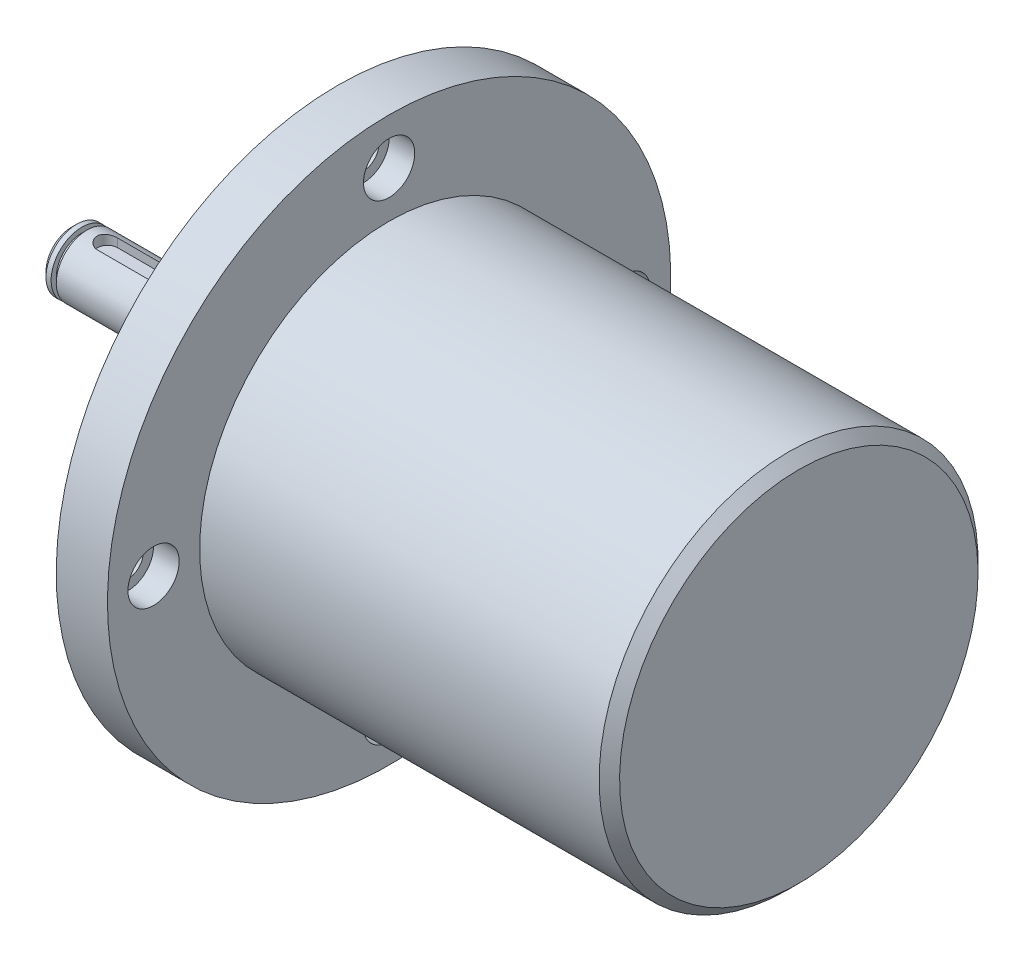
ISO-10303-21;
HEADER;
FILE_DESCRIPTION(('STEP AP214'),'2;1');
FILE_NAME('part.step','',(''),(''),'','','');
FILE_SCHEMA(('AUTOMOTIVE_DESIGN { 1 0 10303 214 1 1 1 1 }'));
ENDSEC;
DATA;
#1=APPLICATION_CONTEXT('core data for automotive mechanical design processes');
#2=APPLICATION_PROTOCOL_DEFINITION('international standard','automotive_design',2000,#1);
#3=PRODUCT_CONTEXT('',#1,'mechanical');
#4=PRODUCT('Part','Part','',(#3));
#5=PRODUCT_RELATED_PRODUCT_CATEGORY('part','',(#4));
#6=PRODUCT_DEFINITION_FORMATION('','',#4);
#7=PRODUCT_DEFINITION_CONTEXT('part definition',#1,'design');
#8=PRODUCT_DEFINITION('design','',#6,#7);
#9=PRODUCT_DEFINITION_SHAPE('','',#8);
#10=(LENGTH_UNIT() NAMED_UNIT(*) SI_UNIT(.MILLI.,.METRE.));
#11=(NAMED_UNIT(*) PLANE_ANGLE_UNIT() SI_UNIT($,.RADIAN.));
#12=(NAMED_UNIT(*) SI_UNIT($,.STERADIAN.) SOLID_ANGLE_UNIT());
#13=UNCERTAINTY_MEASURE_WITH_UNIT(LENGTH_MEASURE(1.E-05),#10,'distance_accuracy_value','');
#14=(GEOMETRIC_REPRESENTATION_CONTEXT(3) GLOBAL_UNCERTAINTY_ASSIGNED_CONTEXT((#13)) GLOBAL_UNIT_ASSIGNED_CONTEXT((#10,
#11,#12)) REPRESENTATION_CONTEXT('',''));
#15=CARTESIAN_POINT('',(0.,0.,0.));
#16=DIRECTION('',(0.,0.,1.));
#17=DIRECTION('',(1.,0.,0.));
#18=AXIS2_PLACEMENT_3D('',#15,#16,#17);
#19=CARTESIAN_POINT('',(142.,0.,0.));
#20=DIRECTION('',(1.,0.,0.));
#21=DIRECTION('',(0.,1.,0.));
#22=AXIS2_PLACEMENT_3D('',#19,#20,#21);
#23=CYLINDRICAL_SURFACE('',#22,5.99999999999998);
#24=CARTESIAN_POINT('',(3.,0.,0.));
#25=DIRECTION('',(1.,0.,0.));
#26=DIRECTION('',(0.,1.,0.));
#27=AXIS2_PLACEMENT_3D('',#24,#25,#26);
#28=CIRCLE('',#27,5.99999999999998);
#29=CARTESIAN_POINT('',(3.,5.99999999999998,0.));
#30=VERTEX_POINT('',#29);
#31=EDGE_CURVE('E174',#30,#30,#28,.T.);
#32=ORIENTED_EDGE('',*,*,#31,.T.);
#33=EDGE_LOOP('',(#32));
#34=FACE_BOUND('',#33,.T.);
#35=CARTESIAN_POINT('',(30.,0.,0.));
#36=DIRECTION('',(1.,0.,0.));
#37=DIRECTION('',(0.,1.,0.));
#38=AXIS2_PLACEMENT_3D('',#35,#36,#37);
#39=CIRCLE('',#38,5.99999999999998);
#40=CARTESIAN_POINT('',(30.,5.99999999999998,0.));
#41=VERTEX_POINT('',#40);
#42=EDGE_CURVE('E171',#41,#41,#39,.T.);
#43=ORIENTED_EDGE('',*,*,#42,.F.);
#44=EDGE_LOOP('',(#43));
#45=FACE_BOUND('',#44,.T.);
#46=DIRECTION('',(1.,0.,0.));
#47=VECTOR('',#46,1.);
#48=CARTESIAN_POINT('',(142.,5.65685424949236,2.));
#49=LINE('',#48,#47);
#50=CARTESIAN_POINT('',(19.,5.65685424949236,2.));
#51=VERTEX_POINT('',#50);
#52=CARTESIAN_POINT('',(7.,5.65685424949236,2.));
#53=VERTEX_POINT('',#52);
#54=EDGE_CURVE('E50',#51,#53,#49,.F.);
#55=ORIENTED_EDGE('',*,*,#54,.T.);
#56=CARTESIAN_POINT('',(7.,5.65685424949236,2.));
#57=CARTESIAN_POINT('',(6.94541900639777,5.65684884188676,2.0000014949184));
#58=CARTESIAN_POINT('',(6.89086587562134,5.65764519886489,1.99776424917478));
#59=CARTESIAN_POINT('',(6.78218283189021,5.6607865457844,1.9888512140728));
#60=CARTESIAN_POINT('',(6.72805280868061,5.66313111768242,1.98217662286705));
#61=CARTESIAN_POINT('',(6.56721571360973,5.672381844493,1.95562135046158));
#62=CARTESIAN_POINT('',(6.46163830745904,5.68150584999028,1.92920846605623));
#63=CARTESIAN_POINT('',(6.25674961511244,5.70456149397716,1.85991682366086));
#64=CARTESIAN_POINT('',(6.15743490625416,5.71849047905857,1.81704715197507));
#65=CARTESIAN_POINT('',(5.96732033198908,5.74957574438919,1.71614645792974));
#66=CARTESIAN_POINT('',(5.87652574186531,5.76673400456215,1.65810612564547));
#67=CARTESIAN_POINT('',(5.70255953735094,5.80308960804093,1.52610278704603));
#68=CARTESIAN_POINT('',(5.61977023907478,5.82233755536616,1.45164996064407));
#69=CARTESIAN_POINT('',(5.46758796441661,5.86027697385954,1.28997688598297));
#70=CARTESIAN_POINT('',(5.39819737348812,5.87896834543704,1.20275436910907));
#71=CARTESIAN_POINT('',(5.27304096239161,5.91427765988453,1.01520729191253));
#72=CARTESIAN_POINT('',(5.21767803119549,5.93082875123706,0.914600178716994));
#73=CARTESIAN_POINT('',(5.12481549662547,5.95939217209315,0.704858499931719));
#74=CARTESIAN_POINT('',(5.08731043635913,5.97140588786618,0.595726551186841));
#75=CARTESIAN_POINT('',(5.03252854781725,5.98918142285844,0.376058690956074));
#76=CARTESIAN_POINT('',(5.01459345489264,5.99514617977145,0.265703668920224));
#77=CARTESIAN_POINT('',(4.99736740294878,6.00087216807632,0.0433979389113458));
#78=CARTESIAN_POINT('',(4.9980720014605,6.00063487762603,-0.0685523824907852));
#79=CARTESIAN_POINT('',(5.01768856621331,5.9941207727053,-0.286207690558785));
#80=CARTESIAN_POINT('',(5.03588527591893,5.98808121982526,-0.391985405251073));
#81=CARTESIAN_POINT('',(5.08878639734824,5.97093921001645,-0.598888128753312));
#82=CARTESIAN_POINT('',(5.12349172441251,5.95983647235461,-0.700012879232928));
#83=CARTESIAN_POINT('',(5.20884273920126,5.93351336542607,-0.896305246061924));
#84=CARTESIAN_POINT('',(5.25969209024468,5.91824075676624,-0.991377011307984));
#85=CARTESIAN_POINT('',(5.3757199027814,5.88516775360086,-1.17184917819498));
#86=CARTESIAN_POINT('',(5.44090226209303,5.86736667195185,-1.25724693942937));
#87=CARTESIAN_POINT('',(5.58734209999369,5.83012543885477,-1.42019467942242));
#88=CARTESIAN_POINT('',(5.66921108721941,5.81064757359827,-1.4971872232254));
#89=CARTESIAN_POINT('',(5.84488297943233,5.77294980945701,-1.63654404964077));
#90=CARTESIAN_POINT('',(5.93868972480648,5.75473031831505,-1.69890360636763));
#91=CARTESIAN_POINT('',(6.13736035670656,5.72140062752633,-1.80800665118557));
#92=CARTESIAN_POINT('',(6.24236702986588,5.70634029896468,-1.85450601901537));
#93=CARTESIAN_POINT('',(6.45929395517991,5.68162194124077,-1.92892046140223));
#94=CARTESIAN_POINT('',(6.5712029867443,5.67195538817984,-1.95686487211071));
#95=CARTESIAN_POINT('',(6.73683727349596,5.66273084189438,-1.98331631256166));
#96=CARTESIAN_POINT('',(6.78928277970846,5.66053335389202,-1.98957012251023));
#97=CARTESIAN_POINT('',(6.89447615679963,5.65759407142796,-1.99790923214239));
#98=CARTESIAN_POINT('',(6.94722354908881,5.65685039859054,-1.99999991078996));
#99=CARTESIAN_POINT('',(7.,5.65685424949236,-2.));
#100=B_SPLINE_CURVE_WITH_KNOTS('',3,(#56,#57,#58,#59,#60,#61,#62,#63,#64,#65,#66,#67,#68,#69,
#70,#71,#72,#73,#74,#75,#76,#77,#78,#79,#80,#81,#82,#83,#84,#85,#86,#87,#88,#89,#90,#91,#92,#93,
#94,#95,#96,#97,#98,#99),.UNSPECIFIED.,.F.,.F.,(4,2,2,2,2,2,2,2,2,2,2,2,2,2,2,2,2,2,2,2,2,4),
(0.,0.163636969470865,0.327229772338923,0.653162396790745,0.978915321932472,1.30486862627062,
1.64233009925355,1.97985159727495,2.32618265866202,2.67240782242254,3.00658941454806,
3.34069136061285,3.6616883693147,3.98270317816496,4.30794037651935,4.63326613177537,
4.973881081161,5.31460588498484,5.6603605985608,6.00556734973678,6.16399790665503,
6.32222363058113),.UNSPECIFIED.);
#101=CARTESIAN_POINT('',(7.,5.65685424949236,-2.));
#102=VERTEX_POINT('',#101);
#103=EDGE_CURVE('E11',#53,#102,#100,.T.);
#104=ORIENTED_EDGE('',*,*,#103,.T.);
#105=DIRECTION('',(1.,0.,0.));
#106=VECTOR('',#105,1.);
#107=CARTESIAN_POINT('',(142.,5.65685424949236,-2.));
#108=LINE('',#107,#106);
#109=CARTESIAN_POINT('',(19.,5.65685424949236,-2.));
#110=VERTEX_POINT('',#109);
#111=EDGE_CURVE('E192',#102,#110,#108,.T.);
#112=ORIENTED_EDGE('',*,*,#111,.T.);
#113=CARTESIAN_POINT('',(19.,5.65685424949236,-2.));
#114=CARTESIAN_POINT('',(19.0545809936022,5.65684884188676,-2.0000014949184));
#115=CARTESIAN_POINT('',(19.1091341243787,5.65764519886488,-1.99776424917478));
#116=CARTESIAN_POINT('',(19.2178171681098,5.6607865457844,-1.9888512140728));
#117=CARTESIAN_POINT('',(19.2719471913194,5.66313111768242,-1.98217662286705));
#118=CARTESIAN_POINT('',(19.4327842863903,5.672381844493,-1.95562135046158));
#119=CARTESIAN_POINT('',(19.538361692541,5.68150584999028,-1.92920846605623));
#120=CARTESIAN_POINT('',(19.7432503848876,5.70456149397716,-1.85991682366086));
#121=CARTESIAN_POINT('',(19.8425650937458,5.71849047905857,-1.81704715197507));
#122=CARTESIAN_POINT('',(20.0326796680109,5.74957574438919,-1.71614645792974));
#123=CARTESIAN_POINT('',(20.1234742581347,5.76673400456215,-1.65810612564547));
#124=CARTESIAN_POINT('',(20.2974404626491,5.80308960804093,-1.52610278704602));
#125=CARTESIAN_POINT('',(20.3802297609252,5.82233755536616,-1.45164996064407));
#126=CARTESIAN_POINT('',(20.5324120355834,5.86027697385954,-1.28997688598297));
#127=CARTESIAN_POINT('',(20.6018026265119,5.87896834543704,-1.20275436910907));
#128=CARTESIAN_POINT('',(20.7269590376084,5.91427765988453,-1.01520729191253));
#129=CARTESIAN_POINT('',(20.7823219688045,5.93082875123706,-0.914600178716994));
#130=CARTESIAN_POINT('',(20.8751845033745,5.95939217209315,-0.704858499931718));
#131=CARTESIAN_POINT('',(20.9126895636409,5.97140588786618,-0.59572655118684));
#132=CARTESIAN_POINT('',(20.9674714521827,5.98918142285844,-0.376058690956073));
#133=CARTESIAN_POINT('',(20.9854065451074,5.99514617977145,-0.265703668920224));
#134=CARTESIAN_POINT('',(21.0026325970512,6.00087216807632,-0.0433979389113463));
#135=CARTESIAN_POINT('',(21.0019279985395,6.00063487762603,0.0685523824907843));
#136=CARTESIAN_POINT('',(20.9823114337867,5.9941207727053,0.286207690558784));
#137=CARTESIAN_POINT('',(20.9641147240811,5.98808121982526,0.391985405251072));
#138=CARTESIAN_POINT('',(20.9112136026518,5.97093921001645,0.598888128753312));
#139=CARTESIAN_POINT('',(20.8765082755875,5.95983647235461,0.700012879232928));
#140=CARTESIAN_POINT('',(20.7911572607987,5.93351336542607,0.896305246061924));
#141=CARTESIAN_POINT('',(20.7403079097553,5.91824075676624,0.991377011307984));
#142=CARTESIAN_POINT('',(20.6242800972186,5.88516775360086,1.17184917819498));
#143=CARTESIAN_POINT('',(20.559097737907,5.86736667195185,1.25724693942937));
#144=CARTESIAN_POINT('',(20.4126579000063,5.83012543885477,1.42019467942243));
#145=CARTESIAN_POINT('',(20.3307889127806,5.81064757359827,1.4971872232254));
#146=CARTESIAN_POINT('',(20.1551170205677,5.77294980945701,1.63654404964077));
#147=CARTESIAN_POINT('',(20.0613102751935,5.75473031831505,1.69890360636763));
#148=CARTESIAN_POINT('',(19.8626396432934,5.72140062752633,1.80800665118557));
#149=CARTESIAN_POINT('',(19.7576329701341,5.70634029896467,1.85450601901536));
#150=CARTESIAN_POINT('',(19.5407060448201,5.68162194124076,1.92892046140223));
#151=CARTESIAN_POINT('',(19.4287970132557,5.67195538817984,1.95686487211071));
#152=CARTESIAN_POINT('',(19.263162726504,5.66273084189438,1.98331631256166));
#153=CARTESIAN_POINT('',(19.2107172202915,5.66053335389202,1.98957012251023));
#154=CARTESIAN_POINT('',(19.1055238432004,5.65759407142796,1.99790923214239));
#155=CARTESIAN_POINT('',(19.0527764509112,5.65685039859054,1.99999991078996));
#156=CARTESIAN_POINT('',(19.,5.65685424949236,2.));
#157=B_SPLINE_CURVE_WITH_KNOTS('',3,(#113,#114,#115,#116,#117,#118,#119,#120,#121,#122,#123,
#124,#125,#126,#127,#128,#129,#130,#131,#132,#133,#134,#135,#136,#137,#138,#139,#140,#141,#142,
#143,#144,#145,#146,#147,#148,#149,#150,#151,#152,#153,#154,#155,#156),.UNSPECIFIED.,.F.,.F.,(4,
2,2,2,2,2,2,2,2,2,2,2,2,2,2,2,2,2,2,2,2,4),(0.,0.163636969470867,0.327229772338926,
0.653162396790745,0.978915321932474,1.30486862627062,1.64233009925355,1.97985159727495,
2.32618265866202,2.67240782242255,3.00658941454806,3.34069136061284,3.6616883693147,
3.98270317816496,4.30794037651935,4.63326613177537,4.97388108116101,5.31460588498485,
5.66036059856079,6.00556734973678,6.16399790665502,6.32222363058113),.UNSPECIFIED.);
#158=EDGE_CURVE('E211',#110,#51,#157,.T.);
#159=ORIENTED_EDGE('',*,*,#158,.T.);
#160=EDGE_LOOP('',(#55,#104,#112,#159));
#161=FACE_BOUND('',#160,.T.);
#162=ADVANCED_FACE('F36',(#34,#45,#161),#23,.T.);
#163=CARTESIAN_POINT('',(0.,0.,0.));
#164=DIRECTION('',(-1.,0.,0.));
#165=DIRECTION('',(0.,-1.,0.));
#166=AXIS2_PLACEMENT_3D('',#163,#164,#165);
#167=PLANE('',#166);
#168=CARTESIAN_POINT('',(0.,0.,0.));
#169=DIRECTION('',(1.,0.,0.));
#170=DIRECTION('',(0.,1.,0.));
#171=AXIS2_PLACEMENT_3D('',#168,#169,#170);
#172=CIRCLE('',#171,5.);
#173=CARTESIAN_POINT('',(0.,5.,0.));
#174=VERTEX_POINT('',#173);
#175=EDGE_CURVE('E189',#174,#174,#172,.T.);
#176=ORIENTED_EDGE('',*,*,#175,.F.);
#177=EDGE_LOOP('',(#176));
#178=FACE_BOUND('',#177,.T.);
#179=ADVANCED_FACE('F38',(#178),#167,.T.);
#180=CARTESIAN_POINT('',(1.,0.,0.));
#181=DIRECTION('',(1.,0.,0.));
#182=DIRECTION('',(0.,1.,0.));
#183=AXIS2_PLACEMENT_3D('',#180,#181,#182);
#184=CONICAL_SURFACE('',#183,5.99999999999998,0.785398163397442);
#185=ORIENTED_EDGE('',*,*,#175,.T.);
#186=EDGE_LOOP('',(#185));
#187=FACE_BOUND('',#186,.T.);
#188=CARTESIAN_POINT('',(1.,0.,0.));
#189=DIRECTION('',(1.,0.,0.));
#190=DIRECTION('',(0.,1.,0.));
#191=AXIS2_PLACEMENT_3D('',#188,#189,#190);
#192=CIRCLE('',#191,5.99999999999998);
#193=CARTESIAN_POINT('',(1.,5.99999999999998,0.));
#194=VERTEX_POINT('',#193);
#195=EDGE_CURVE('E186',#194,#194,#192,.T.);
#196=ORIENTED_EDGE('',*,*,#195,.F.);
#197=EDGE_LOOP('',(#196));
#198=FACE_BOUND('',#197,.T.);
#199=ADVANCED_FACE('F335',(#187,#198),#184,.T.);
#200=CARTESIAN_POINT('',(142.,0.,0.));
#201=DIRECTION('',(1.,0.,0.));
#202=DIRECTION('',(0.,1.,0.));
#203=AXIS2_PLACEMENT_3D('',#200,#201,#202);
#204=CYLINDRICAL_SURFACE('',#203,5.99999999999998);
#205=ORIENTED_EDGE('',*,*,#195,.T.);
#206=EDGE_LOOP('',(#205));
#207=FACE_BOUND('',#206,.T.);
#208=CARTESIAN_POINT('',(2.,0.,0.));
#209=DIRECTION('',(1.,0.,0.));
#210=DIRECTION('',(0.,1.,0.));
#211=AXIS2_PLACEMENT_3D('',#208,#209,#210);
#212=CIRCLE('',#211,5.99999999999998);
#213=CARTESIAN_POINT('',(2.,5.99999999999998,0.));
#214=VERTEX_POINT('',#213);
#215=EDGE_CURVE('E183',#214,#214,#212,.T.);
#216=ORIENTED_EDGE('',*,*,#215,.F.);
#217=EDGE_LOOP('',(#216));
#218=FACE_BOUND('',#217,.T.);
#219=ADVANCED_FACE('F534',(#207,#218),#204,.T.);
#220=CARTESIAN_POINT('',(2.,5.99999999999998,0.));
#221=DIRECTION('',(1.,0.,0.));
#222=DIRECTION('',(0.,1.,0.));
#223=AXIS2_PLACEMENT_3D('',#220,#221,#222);
#224=PLANE('',#223);
#225=ORIENTED_EDGE('',*,*,#215,.T.);
#226=EDGE_LOOP('',(#225));
#227=FACE_BOUND('',#226,.T.);
#228=CARTESIAN_POINT('',(2.,0.,0.));
#229=DIRECTION('',(1.,0.,0.));
#230=DIRECTION('',(0.,1.,0.));
#231=AXIS2_PLACEMENT_3D('',#228,#229,#230);
#232=CIRCLE('',#231,4.99999999999998);
#233=CARTESIAN_POINT('',(2.,4.99999999999998,0.));
#234=VERTEX_POINT('',#233);
#235=EDGE_CURVE('E180',#234,#234,#232,.T.);
#236=ORIENTED_EDGE('',*,*,#235,.F.);
#237=EDGE_LOOP('',(#236));
#238=FACE_BOUND('',#237,.T.);
#239=ADVANCED_FACE('F524',(#227,#238),#224,.T.);
#240=CARTESIAN_POINT('',(142.,0.,0.));
#241=DIRECTION('',(1.,0.,0.));
#242=DIRECTION('',(0.,1.,0.));
#243=AXIS2_PLACEMENT_3D('',#240,#241,#242);
#244=CYLINDRICAL_SURFACE('',#243,4.99999999999998);
#245=ORIENTED_EDGE('',*,*,#235,.T.);
#246=EDGE_LOOP('',(#245));
#247=FACE_BOUND('',#246,.T.);
#248=CARTESIAN_POINT('',(3.,0.,0.));
#249=DIRECTION('',(1.,0.,0.));
#250=DIRECTION('',(0.,1.,0.));
#251=AXIS2_PLACEMENT_3D('',#248,#249,#250);
#252=CIRCLE('',#251,4.99999999999998);
#253=CARTESIAN_POINT('',(3.,4.99999999999998,0.));
#254=VERTEX_POINT('',#253);
#255=EDGE_CURVE('E177',#254,#254,#252,.T.);
#256=ORIENTED_EDGE('',*,*,#255,.F.);
#257=EDGE_LOOP('',(#256));
#258=FACE_BOUND('',#257,.T.);
#259=ADVANCED_FACE('F327',(#247,#258),#244,.T.);
#260=CARTESIAN_POINT('',(3.,4.99999999999998,0.));
#261=DIRECTION('',(-1.,0.,0.));
#262=DIRECTION('',(0.,-1.,0.));
#263=AXIS2_PLACEMENT_3D('',#260,#261,#262);
#264=PLANE('',#263);
#265=ORIENTED_EDGE('',*,*,#255,.T.);
#266=EDGE_LOOP('',(#265));
#267=FACE_BOUND('',#266,.T.);
#268=ORIENTED_EDGE('',*,*,#31,.F.);
#269=EDGE_LOOP('',(#268));
#270=FACE_BOUND('',#269,.T.);
#271=ADVANCED_FACE('F322',(#267,#270),#264,.T.);
#272=CARTESIAN_POINT('',(30.,5.99999999999998,0.));
#273=DIRECTION('',(-1.,0.,0.));
#274=DIRECTION('',(0.,-1.,0.));
#275=AXIS2_PLACEMENT_3D('',#272,#273,#274);
#276=PLANE('',#275);
#277=ORIENTED_EDGE('',*,*,#42,.T.);
#278=EDGE_LOOP('',(#277));
#279=FACE_BOUND('',#278,.T.);
#280=CARTESIAN_POINT('',(30.,0.,0.));
#281=DIRECTION('',(1.,0.,0.));
#282=DIRECTION('',(0.,1.,0.));
#283=AXIS2_PLACEMENT_3D('',#280,#281,#282);
#284=CIRCLE('',#283,9.99999999999998);
#285=CARTESIAN_POINT('',(30.,9.99999999999998,0.));
#286=VERTEX_POINT('',#285);
#287=EDGE_CURVE('E168',#286,#286,#284,.T.);
#288=ORIENTED_EDGE('',*,*,#287,.F.);
#289=EDGE_LOOP('',(#288));
#290=FACE_BOUND('',#289,.T.);
#291=ADVANCED_FACE('F319',(#279,#290),#276,.T.);
#292=CARTESIAN_POINT('',(142.,0.,0.));
#293=DIRECTION('',(1.,0.,0.));
#294=DIRECTION('',(0.,1.,0.));
#295=AXIS2_PLACEMENT_3D('',#292,#293,#294);
#296=CYLINDRICAL_SURFACE('',#295,9.99999999999998);
#297=ORIENTED_EDGE('',*,*,#287,.T.);
#298=EDGE_LOOP('',(#297));
#299=FACE_BOUND('',#298,.T.);
#300=CARTESIAN_POINT('',(49.,0.,0.));
#301=DIRECTION('',(1.,0.,0.));
#302=DIRECTION('',(0.,1.,0.));
#303=AXIS2_PLACEMENT_3D('',#300,#301,#302);
#304=CIRCLE('',#303,9.99999999999998);
#305=CARTESIAN_POINT('',(49.,9.99999999999998,0.));
#306=VERTEX_POINT('',#305);
#307=EDGE_CURVE('E165',#306,#306,#304,.T.);
#308=ORIENTED_EDGE('',*,*,#307,.F.);
#309=EDGE_LOOP('',(#308));
#310=FACE_BOUND('',#309,.T.);
#311=ADVANCED_FACE('F316',(#299,#310),#296,.T.);
#312=CARTESIAN_POINT('',(49.,9.99999999999998,0.));
#313=DIRECTION('',(-1.,0.,0.));
#314=DIRECTION('',(0.,-1.,0.));
#315=AXIS2_PLACEMENT_3D('',#312,#313,#314);
#316=PLANE('',#315);
#317=ORIENTED_EDGE('',*,*,#307,.T.);
#318=EDGE_LOOP('',(#317));
#319=FACE_BOUND('',#318,.T.);
#320=CARTESIAN_POINT('',(49.,0.,0.));
#321=DIRECTION('',(1.,0.,0.));
#322=DIRECTION('',(0.,1.,0.));
#323=AXIS2_PLACEMENT_3D('',#320,#321,#322);
#324=CIRCLE('',#323,24.);
#325=CARTESIAN_POINT('',(49.,24.,0.));
#326=VERTEX_POINT('',#325);
#327=EDGE_CURVE('E162',#326,#326,#324,.T.);
#328=ORIENTED_EDGE('',*,*,#327,.F.);
#329=EDGE_LOOP('',(#328));
#330=FACE_BOUND('',#329,.T.);
#331=ADVANCED_FACE('F312',(#319,#330),#316,.T.);
#332=CARTESIAN_POINT('',(50.,0.,0.));
#333=DIRECTION('',(1.,0.,0.));
#334=DIRECTION('',(0.,1.,0.));
#335=AXIS2_PLACEMENT_3D('',#332,#333,#334);
#336=CONICAL_SURFACE('',#335,25.,0.785398163397442);
#337=ORIENTED_EDGE('',*,*,#327,.T.);
#338=EDGE_LOOP('',(#337));
#339=FACE_BOUND('',#338,.T.);
#340=CARTESIAN_POINT('',(50.,0.,0.));
#341=DIRECTION('',(1.,0.,0.));
#342=DIRECTION('',(0.,1.,0.));
#343=AXIS2_PLACEMENT_3D('',#340,#341,#342);
#344=CIRCLE('',#343,25.);
#345=CARTESIAN_POINT('',(50.,25.,0.));
#346=VERTEX_POINT('',#345);
#347=EDGE_CURVE('E159',#346,#346,#344,.T.);
#348=ORIENTED_EDGE('',*,*,#347,.F.);
#349=EDGE_LOOP('',(#348));
#350=FACE_BOUND('',#349,.T.);
#351=ADVANCED_FACE('F308',(#339,#350),#336,.T.);
#352=CARTESIAN_POINT('',(142.,0.,0.));
#353=DIRECTION('',(1.,0.,0.));
#354=DIRECTION('',(0.,1.,0.));
#355=AXIS2_PLACEMENT_3D('',#352,#353,#354);
#356=CYLINDRICAL_SURFACE('',#355,25.);
#357=ORIENTED_EDGE('',*,*,#347,.T.);
#358=EDGE_LOOP('',(#357));
#359=FACE_BOUND('',#358,.T.);
#360=CARTESIAN_POINT('',(52.,0.,0.));
#361=DIRECTION('',(1.,0.,0.));
#362=DIRECTION('',(0.,1.,0.));
#363=AXIS2_PLACEMENT_3D('',#360,#361,#362);
#364=CIRCLE('',#363,25.);
#365=CARTESIAN_POINT('',(52.,25.,0.));
#366=VERTEX_POINT('',#365);
#367=EDGE_CURVE('E156',#366,#366,#364,.T.);
#368=ORIENTED_EDGE('',*,*,#367,.F.);
#369=EDGE_LOOP('',(#368));
#370=FACE_BOUND('',#369,.T.);
#371=ADVANCED_FACE('F304',(#359,#370),#356,.T.);
#372=CARTESIAN_POINT('',(52.,25.,0.));
#373=DIRECTION('',(-1.,0.,0.));
#374=DIRECTION('',(0.,-1.,0.));
#375=AXIS2_PLACEMENT_3D('',#372,#373,#374);
#376=PLANE('',#375);
#377=CARTESIAN_POINT('',(52.,4.81824424760352E-13,46.));
#378=DIRECTION('',(-1.,0.,0.));
#379=DIRECTION('',(0.,-1.,0.));
#380=AXIS2_PLACEMENT_3D('',#377,#378,#379);
#381=CIRCLE('',#380,3.);
#382=CARTESIAN_POINT('',(52.,-2.99999999999952,46.));
#383=VERTEX_POINT('',#382);
#384=EDGE_CURVE('E120',#383,#383,#381,.F.);
#385=ORIENTED_EDGE('',*,*,#384,.T.);
#386=EDGE_LOOP('',(#385));
#387=FACE_BOUND('',#386,.T.);
#388=CARTESIAN_POINT('',(52.,-46.,0.));
#389=DIRECTION('',(-1.,0.,0.));
#390=DIRECTION('',(0.,-1.,0.));
#391=AXIS2_PLACEMENT_3D('',#388,#389,#390);
#392=CIRCLE('',#391,3.);
#393=CARTESIAN_POINT('',(52.,-49.,0.));
#394=VERTEX_POINT('',#393);
#395=EDGE_CURVE('E128',#394,#394,#392,.F.);
#396=ORIENTED_EDGE('',*,*,#395,.T.);
#397=EDGE_LOOP('',(#396));
#398=FACE_BOUND('',#397,.T.);
#399=CARTESIAN_POINT('',(52.,-1.60608141586784E-13,-46.));
#400=DIRECTION('',(-1.,0.,0.));
#401=DIRECTION('',(0.,-1.,0.));
#402=AXIS2_PLACEMENT_3D('',#399,#400,#401);
#403=CIRCLE('',#402,3.);
#404=CARTESIAN_POINT('',(52.,-3.00000000000016,-46.));
#405=VERTEX_POINT('',#404);
#406=EDGE_CURVE('E136',#405,#405,#403,.F.);
#407=ORIENTED_EDGE('',*,*,#406,.T.);
#408=EDGE_LOOP('',(#407));
#409=FACE_BOUND('',#408,.T.);
#410=CARTESIAN_POINT('',(52.,46.,0.));
#411=DIRECTION('',(-1.,0.,0.));
#412=DIRECTION('',(0.,-1.,0.));
#413=AXIS2_PLACEMENT_3D('',#410,#411,#412);
#414=CIRCLE('',#413,3.);
#415=CARTESIAN_POINT('',(52.,43.,0.));
#416=VERTEX_POINT('',#415);
#417=EDGE_CURVE('E144',#416,#416,#414,.F.);
#418=ORIENTED_EDGE('',*,*,#417,.T.);
#419=EDGE_LOOP('',(#418));
#420=FACE_BOUND('',#419,.T.);
#421=ORIENTED_EDGE('',*,*,#367,.T.);
#422=EDGE_LOOP('',(#421));
#423=FACE_BOUND('',#422,.T.);
#424=CARTESIAN_POINT('',(52.,0.,0.));
#425=DIRECTION('',(1.,0.,0.));
#426=DIRECTION('',(0.,1.,0.));
#427=AXIS2_PLACEMENT_3D('',#424,#425,#426);
#428=CIRCLE('',#427,55.);
#429=CARTESIAN_POINT('',(52.,55.,0.));
#430=VERTEX_POINT('',#429);
#431=EDGE_CURVE('E153',#430,#430,#428,.T.);
#432=ORIENTED_EDGE('',*,*,#431,.F.);
#433=EDGE_LOOP('',(#432));
#434=FACE_BOUND('',#433,.T.);
#435=ADVANCED_FACE('F300',(#387,#398,#409,#420,#423,#434),#376,.T.);
#436=CARTESIAN_POINT('',(142.,0.,0.));
#437=DIRECTION('',(1.,0.,0.));
#438=DIRECTION('',(0.,1.,0.));
#439=AXIS2_PLACEMENT_3D('',#436,#437,#438);
#440=CYLINDRICAL_SURFACE('',#439,55.);
#441=ORIENTED_EDGE('',*,*,#431,.T.);
#442=EDGE_LOOP('',(#441));
#443=FACE_BOUND('',#442,.T.);
#444=CARTESIAN_POINT('',(62.,0.,0.));
#445=DIRECTION('',(1.,0.,0.));
#446=DIRECTION('',(0.,1.,0.));
#447=AXIS2_PLACEMENT_3D('',#444,#445,#446);
#448=CIRCLE('',#447,55.);
#449=CARTESIAN_POINT('',(62.,55.,0.));
#450=VERTEX_POINT('',#449);
#451=EDGE_CURVE('E150',#450,#450,#448,.T.);
#452=ORIENTED_EDGE('',*,*,#451,.F.);
#453=EDGE_LOOP('',(#452));
#454=FACE_BOUND('',#453,.T.);
#455=ADVANCED_FACE('F296',(#443,#454),#440,.T.);
#456=CARTESIAN_POINT('',(62.,55.,0.));
#457=DIRECTION('',(1.,0.,0.));
#458=DIRECTION('',(0.,1.,0.));
#459=AXIS2_PLACEMENT_3D('',#456,#457,#458);
#460=PLANE('',#459);
#461=CARTESIAN_POINT('',(62.,4.81824424760352E-13,46.));
#462=DIRECTION('',(1.,0.,0.));
#463=DIRECTION('',(0.,1.,0.));
#464=AXIS2_PLACEMENT_3D('',#461,#462,#463);
#465=CIRCLE('',#464,5.);
#466=CARTESIAN_POINT('',(62.,5.00000000000048,46.));
#467=VERTEX_POINT('',#466);
#468=EDGE_CURVE('E115',#467,#467,#465,.F.);
#469=ORIENTED_EDGE('',*,*,#468,.T.);
#470=EDGE_LOOP('',(#469));
#471=FACE_BOUND('',#470,.T.);
#472=CARTESIAN_POINT('',(62.,-46.,0.));
#473=DIRECTION('',(1.,0.,0.));
#474=DIRECTION('',(0.,1.,0.));
#475=AXIS2_PLACEMENT_3D('',#472,#473,#474);
#476=CIRCLE('',#475,5.);
#477=CARTESIAN_POINT('',(62.,-41.,0.));
#478=VERTEX_POINT('',#477);
#479=EDGE_CURVE('E123',#478,#478,#476,.F.);
#480=ORIENTED_EDGE('',*,*,#479,.T.);
#481=EDGE_LOOP('',(#480));
#482=FACE_BOUND('',#481,.T.);
#483=CARTESIAN_POINT('',(62.,-1.60608141586784E-13,-46.));
#484=DIRECTION('',(1.,0.,0.));
#485=DIRECTION('',(0.,1.,0.));
#486=AXIS2_PLACEMENT_3D('',#483,#484,#485);
#487=CIRCLE('',#486,5.);
#488=CARTESIAN_POINT('',(62.,4.99999999999984,-46.));
#489=VERTEX_POINT('',#488);
#490=EDGE_CURVE('E131',#489,#489,#487,.F.);
#491=ORIENTED_EDGE('',*,*,#490,.T.);
#492=EDGE_LOOP('',(#491));
#493=FACE_BOUND('',#492,.T.);
#494=CARTESIAN_POINT('',(62.,46.,0.));
#495=DIRECTION('',(1.,0.,0.));
#496=DIRECTION('',(0.,1.,0.));
#497=AXIS2_PLACEMENT_3D('',#494,#495,#496);
#498=CIRCLE('',#497,5.);
#499=CARTESIAN_POINT('',(62.,51.,0.));
#500=VERTEX_POINT('',#499);
#501=EDGE_CURVE('E139',#500,#500,#498,.F.);
#502=ORIENTED_EDGE('',*,*,#501,.T.);
#503=EDGE_LOOP('',(#502));
#504=FACE_BOUND('',#503,.T.);
#505=ORIENTED_EDGE('',*,*,#451,.T.);
#506=EDGE_LOOP('',(#505));
#507=FACE_BOUND('',#506,.T.);
#508=CARTESIAN_POINT('',(62.,0.,0.));
#509=DIRECTION('',(1.,0.,0.));
#510=DIRECTION('',(0.,1.,0.));
#511=AXIS2_PLACEMENT_3D('',#508,#509,#510);
#512=CIRCLE('',#511,37.);
#513=CARTESIAN_POINT('',(62.,37.,0.));
#514=VERTEX_POINT('',#513);
#515=EDGE_CURVE('E147',#514,#514,#512,.T.);
#516=ORIENTED_EDGE('',*,*,#515,.F.);
#517=EDGE_LOOP('',(#516));
#518=FACE_BOUND('',#517,.T.);
#519=ADVANCED_FACE('F292',(#471,#482,#493,#504,#507,#518),#460,.T.);
#520=CARTESIAN_POINT('',(142.,0.,0.));
#521=DIRECTION('',(1.,0.,0.));
#522=DIRECTION('',(0.,1.,0.));
#523=AXIS2_PLACEMENT_3D('',#520,#521,#522);
#524=CYLINDRICAL_SURFACE('',#523,37.);
#525=ORIENTED_EDGE('',*,*,#515,.T.);
#526=EDGE_LOOP('',(#525));
#527=FACE_BOUND('',#526,.T.);
#528=CARTESIAN_POINT('',(140.,0.,0.));
#529=DIRECTION('',(1.,0.,0.));
#530=DIRECTION('',(0.,1.,0.));
#531=AXIS2_PLACEMENT_3D('',#528,#529,#530);
#532=CIRCLE('',#531,37.);
#533=CARTESIAN_POINT('',(140.,37.,0.));
#534=VERTEX_POINT('',#533);
#535=EDGE_CURVE('E143',#534,#534,#532,.T.);
#536=ORIENTED_EDGE('',*,*,#535,.F.);
#537=EDGE_LOOP('',(#536));
#538=FACE_BOUND('',#537,.T.);
#539=ADVANCED_FACE('F288',(#527,#538),#524,.T.);
#540=CARTESIAN_POINT('',(142.,0.,0.));
#541=DIRECTION('',(-1.,0.,0.));
#542=DIRECTION('',(0.,-1.,0.));
#543=AXIS2_PLACEMENT_3D('',#540,#541,#542);
#544=CONICAL_SURFACE('',#543,35.,0.785398163397447);
#545=ORIENTED_EDGE('',*,*,#535,.T.);
#546=EDGE_LOOP('',(#545));
#547=FACE_BOUND('',#546,.T.);
#548=CARTESIAN_POINT('',(142.,0.,0.));
#549=DIRECTION('',(1.,0.,0.));
#550=DIRECTION('',(0.,1.,0.));
#551=AXIS2_PLACEMENT_3D('',#548,#549,#550);
#552=CIRCLE('',#551,35.);
#553=CARTESIAN_POINT('',(142.,35.,0.));
#554=VERTEX_POINT('',#553);
#555=EDGE_CURVE('E140',#554,#554,#552,.T.);
#556=ORIENTED_EDGE('',*,*,#555,.F.);
#557=EDGE_LOOP('',(#556));
#558=FACE_BOUND('',#557,.T.);
#559=ADVANCED_FACE('F284',(#547,#558),#544,.T.);
#560=CARTESIAN_POINT('',(142.,35.,0.));
#561=DIRECTION('',(1.,0.,0.));
#562=DIRECTION('',(0.,1.,0.));
#563=AXIS2_PLACEMENT_3D('',#560,#561,#562);
#564=PLANE('',#563);
#565=ORIENTED_EDGE('',*,*,#555,.T.);
#566=EDGE_LOOP('',(#565));
#567=FACE_BOUND('',#566,.T.);
#568=ADVANCED_FACE('F280',(#567),#564,.T.);
#569=CARTESIAN_POINT('',(44.0570284395677,46.,0.));
#570=DIRECTION('',(-1.,0.,0.));
#571=DIRECTION('',(0.,0.,1.));
#572=AXIS2_PLACEMENT_3D('',#569,#570,#571);
#573=CYLINDRICAL_SURFACE('',#572,5.);
#574=ORIENTED_EDGE('',*,*,#501,.F.);
#575=EDGE_LOOP('',(#574));
#576=FACE_BOUND('',#575,.T.);
#577=CARTESIAN_POINT('',(57.,46.,0.));
#578=DIRECTION('',(-1.,0.,0.));
#579=DIRECTION('',(0.,0.,1.));
#580=AXIS2_PLACEMENT_3D('',#577,#578,#579);
#581=CIRCLE('',#580,5.);
#582=CARTESIAN_POINT('',(57.,46.,5.));
#583=VERTEX_POINT('',#582);
#584=EDGE_CURVE('E135',#583,#583,#581,.T.);
#585=ORIENTED_EDGE('',*,*,#584,.T.);
#586=EDGE_LOOP('',(#585));
#587=FACE_BOUND('',#586,.T.);
#588=ADVANCED_FACE('F276',(#576,#587),#573,.F.);
#589=CARTESIAN_POINT('',(57.,51.,0.));
#590=DIRECTION('',(1.,0.,0.));
#591=DIRECTION('',(0.,0.,-1.));
#592=AXIS2_PLACEMENT_3D('',#589,#590,#591);
#593=PLANE('',#592);
#594=CARTESIAN_POINT('',(57.,46.,0.));
#595=DIRECTION('',(-1.,0.,0.));
#596=DIRECTION('',(0.,0.,1.));
#597=AXIS2_PLACEMENT_3D('',#594,#595,#596);
#598=CIRCLE('',#597,3.);
#599=CARTESIAN_POINT('',(57.,46.,3.));
#600=VERTEX_POINT('',#599);
#601=EDGE_CURVE('E132',#600,#600,#598,.T.);
#602=ORIENTED_EDGE('',*,*,#601,.T.);
#603=EDGE_LOOP('',(#602));
#604=FACE_BOUND('',#603,.T.);
#605=ORIENTED_EDGE('',*,*,#584,.F.);
#606=EDGE_LOOP('',(#605));
#607=FACE_BOUND('',#606,.T.);
#608=ADVANCED_FACE('F272',(#604,#607),#593,.T.);
#609=CARTESIAN_POINT('',(44.0570284395677,46.,0.));
#610=DIRECTION('',(-1.,0.,0.));
#611=DIRECTION('',(0.,0.,1.));
#612=AXIS2_PLACEMENT_3D('',#609,#610,#611);
#613=CYLINDRICAL_SURFACE('',#612,3.);
#614=ORIENTED_EDGE('',*,*,#417,.F.);
#615=EDGE_LOOP('',(#614));
#616=FACE_BOUND('',#615,.T.);
#617=ORIENTED_EDGE('',*,*,#601,.F.);
#618=EDGE_LOOP('',(#617));
#619=FACE_BOUND('',#618,.T.);
#620=ADVANCED_FACE('F268',(#616,#619),#613,.F.);
#621=CARTESIAN_POINT('',(44.0570284395677,-1.60608141586784E-13,-46.));
#622=DIRECTION('',(-1.,0.,0.));
#623=DIRECTION('',(0.,1.,0.));
#624=AXIS2_PLACEMENT_3D('',#621,#622,#623);
#625=CYLINDRICAL_SURFACE('',#624,5.);
#626=ORIENTED_EDGE('',*,*,#490,.F.);
#627=EDGE_LOOP('',(#626));
#628=FACE_BOUND('',#627,.T.);
#629=CARTESIAN_POINT('',(57.,-1.60608141586784E-13,-46.));
#630=DIRECTION('',(-1.,0.,0.));
#631=DIRECTION('',(0.,1.,0.));
#632=AXIS2_PLACEMENT_3D('',#629,#630,#631);
#633=CIRCLE('',#632,5.);
#634=CARTESIAN_POINT('',(57.,4.99999999999984,-46.));
#635=VERTEX_POINT('',#634);
#636=EDGE_CURVE('E127',#635,#635,#633,.T.);
#637=ORIENTED_EDGE('',*,*,#636,.T.);
#638=EDGE_LOOP('',(#637));
#639=FACE_BOUND('',#638,.T.);
#640=ADVANCED_FACE('F264',(#628,#639),#625,.F.);
#641=CARTESIAN_POINT('',(57.,-1.78065548281E-13,-51.));
#642=DIRECTION('',(1.,0.,0.));
#643=DIRECTION('',(0.,-1.,0.));
#644=AXIS2_PLACEMENT_3D('',#641,#642,#643);
#645=PLANE('',#644);
#646=CARTESIAN_POINT('',(57.,-1.60608141586784E-13,-46.));
#647=DIRECTION('',(-1.,0.,0.));
#648=DIRECTION('',(0.,1.,0.));
#649=AXIS2_PLACEMENT_3D('',#646,#647,#648);
#650=CIRCLE('',#649,3.);
#651=CARTESIAN_POINT('',(57.,2.99999999999984,-46.));
#652=VERTEX_POINT('',#651);
#653=EDGE_CURVE('E124',#652,#652,#650,.T.);
#654=ORIENTED_EDGE('',*,*,#653,.T.);
#655=EDGE_LOOP('',(#654));
#656=FACE_BOUND('',#655,.T.);
#657=ORIENTED_EDGE('',*,*,#636,.F.);
#658=EDGE_LOOP('',(#657));
#659=FACE_BOUND('',#658,.T.);
#660=ADVANCED_FACE('F260',(#656,#659),#645,.T.);
#661=CARTESIAN_POINT('',(44.0570284395677,-1.60608141586784E-13,-46.));
#662=DIRECTION('',(-1.,0.,0.));
#663=DIRECTION('',(0.,1.,0.));
#664=AXIS2_PLACEMENT_3D('',#661,#662,#663);
#665=CYLINDRICAL_SURFACE('',#664,3.);
#666=ORIENTED_EDGE('',*,*,#406,.F.);
#667=EDGE_LOOP('',(#666));
#668=FACE_BOUND('',#667,.T.);
#669=ORIENTED_EDGE('',*,*,#653,.F.);
#670=EDGE_LOOP('',(#669));
#671=FACE_BOUND('',#670,.T.);
#672=ADVANCED_FACE('F256',(#668,#671),#665,.F.);
#673=CARTESIAN_POINT('',(44.0570284395677,-46.,0.));
#674=DIRECTION('',(-1.,0.,0.));
#675=DIRECTION('',(0.,0.,-1.));
#676=AXIS2_PLACEMENT_3D('',#673,#674,#675);
#677=CYLINDRICAL_SURFACE('',#676,5.);
#678=ORIENTED_EDGE('',*,*,#479,.F.);
#679=EDGE_LOOP('',(#678));
#680=FACE_BOUND('',#679,.T.);
#681=CARTESIAN_POINT('',(57.,-46.,0.));
#682=DIRECTION('',(-1.,0.,0.));
#683=DIRECTION('',(0.,0.,-1.));
#684=AXIS2_PLACEMENT_3D('',#681,#682,#683);
#685=CIRCLE('',#684,5.);
#686=CARTESIAN_POINT('',(57.,-46.,-5.));
#687=VERTEX_POINT('',#686);
#688=EDGE_CURVE('E119',#687,#687,#685,.T.);
#689=ORIENTED_EDGE('',*,*,#688,.T.);
#690=EDGE_LOOP('',(#689));
#691=FACE_BOUND('',#690,.T.);
#692=ADVANCED_FACE('F252',(#680,#691),#677,.F.);
#693=CARTESIAN_POINT('',(57.,-51.,0.));
#694=DIRECTION('',(1.,0.,0.));
#695=DIRECTION('',(0.,0.,1.));
#696=AXIS2_PLACEMENT_3D('',#693,#694,#695);
#697=PLANE('',#696);
#698=CARTESIAN_POINT('',(57.,-46.,0.));
#699=DIRECTION('',(-1.,0.,0.));
#700=DIRECTION('',(0.,0.,-1.));
#701=AXIS2_PLACEMENT_3D('',#698,#699,#700);
#702=CIRCLE('',#701,3.);
#703=CARTESIAN_POINT('',(57.,-46.,-3.));
#704=VERTEX_POINT('',#703);
#705=EDGE_CURVE('E116',#704,#704,#702,.T.);
#706=ORIENTED_EDGE('',*,*,#705,.T.);
#707=EDGE_LOOP('',(#706));
#708=FACE_BOUND('',#707,.T.);
#709=ORIENTED_EDGE('',*,*,#688,.F.);
#710=EDGE_LOOP('',(#709));
#711=FACE_BOUND('',#710,.T.);
#712=ADVANCED_FACE('F248',(#708,#711),#697,.T.);
#713=CARTESIAN_POINT('',(44.0570284395677,-46.,0.));
#714=DIRECTION('',(-1.,0.,0.));
#715=DIRECTION('',(0.,0.,-1.));
#716=AXIS2_PLACEMENT_3D('',#713,#714,#715);
#717=CYLINDRICAL_SURFACE('',#716,3.);
#718=ORIENTED_EDGE('',*,*,#395,.F.);
#719=EDGE_LOOP('',(#718));
#720=FACE_BOUND('',#719,.T.);
#721=ORIENTED_EDGE('',*,*,#705,.F.);
#722=EDGE_LOOP('',(#721));
#723=FACE_BOUND('',#722,.T.);
#724=ADVANCED_FACE('F244',(#720,#723),#717,.F.);
#725=CARTESIAN_POINT('',(44.0570284395677,4.81824424760352E-13,46.));
#726=DIRECTION('',(-1.,0.,0.));
#727=DIRECTION('',(0.,-1.,0.));
#728=AXIS2_PLACEMENT_3D('',#725,#726,#727);
#729=CYLINDRICAL_SURFACE('',#728,5.);
#730=ORIENTED_EDGE('',*,*,#468,.F.);
#731=EDGE_LOOP('',(#730));
#732=FACE_BOUND('',#731,.T.);
#733=CARTESIAN_POINT('',(57.,4.81824424760352E-13,46.));
#734=DIRECTION('',(-1.,0.,0.));
#735=DIRECTION('',(0.,-1.,0.));
#736=AXIS2_PLACEMENT_3D('',#733,#734,#735);
#737=CIRCLE('',#736,5.);
#738=CARTESIAN_POINT('',(57.,-4.99999999999952,46.0000000000001));
#739=VERTEX_POINT('',#738);
#740=EDGE_CURVE('E112',#739,#739,#737,.T.);
#741=ORIENTED_EDGE('',*,*,#740,.T.);
#742=EDGE_LOOP('',(#741));
#743=FACE_BOUND('',#742,.T.);
#744=ADVANCED_FACE('F240',(#732,#743),#729,.F.);
#745=CARTESIAN_POINT('',(57.,5.34196644842999E-13,51.));
#746=DIRECTION('',(1.,0.,0.));
#747=DIRECTION('',(0.,1.,0.));
#748=AXIS2_PLACEMENT_3D('',#745,#746,#747);
#749=PLANE('',#748);
#750=CARTESIAN_POINT('',(57.,4.81824424760352E-13,46.));
#751=DIRECTION('',(-1.,0.,0.));
#752=DIRECTION('',(0.,-1.,0.));
#753=AXIS2_PLACEMENT_3D('',#750,#751,#752);
#754=CIRCLE('',#753,3.);
#755=CARTESIAN_POINT('',(57.,-2.99999999999952,46.));
#756=VERTEX_POINT('',#755);
#757=EDGE_CURVE('E87',#756,#756,#754,.T.);
#758=ORIENTED_EDGE('',*,*,#757,.T.);
#759=EDGE_LOOP('',(#758));
#760=FACE_BOUND('',#759,.T.);
#761=ORIENTED_EDGE('',*,*,#740,.F.);
#762=EDGE_LOOP('',(#761));
#763=FACE_BOUND('',#762,.T.);
#764=ADVANCED_FACE('F236',(#760,#763),#749,.T.);
#765=CARTESIAN_POINT('',(44.0570284395677,4.81824424760352E-13,46.));
#766=DIRECTION('',(-1.,0.,0.));
#767=DIRECTION('',(0.,-1.,0.));
#768=AXIS2_PLACEMENT_3D('',#765,#766,#767);
#769=CYLINDRICAL_SURFACE('',#768,3.);
#770=ORIENTED_EDGE('',*,*,#384,.F.);
#771=EDGE_LOOP('',(#770));
#772=FACE_BOUND('',#771,.T.);
#773=ORIENTED_EDGE('',*,*,#757,.F.);
#774=EDGE_LOOP('',(#773));
#775=FACE_BOUND('',#774,.T.);
#776=ADVANCED_FACE('F233',(#772,#775),#769,.F.);
#777=CARTESIAN_POINT('',(7.,14.,0.));
#778=DIRECTION('',(0.,-1.,0.));
#779=DIRECTION('',(0.,0.,-1.));
#780=AXIS2_PLACEMENT_3D('',#777,#778,#779);
#781=CYLINDRICAL_SURFACE('',#780,2.);
#782=DIRECTION('',(0.,-1.,0.));
#783=VECTOR('',#782,1.);
#784=CARTESIAN_POINT('',(7.,14.,2.));
#785=LINE('',#784,#783);
#786=CARTESIAN_POINT('',(7.,4.,2.));
#787=VERTEX_POINT('',#786);
#788=EDGE_CURVE('E80',#53,#787,#785,.T.);
#789=ORIENTED_EDGE('',*,*,#788,.T.);
#790=CARTESIAN_POINT('',(7.,4.,0.));
#791=DIRECTION('',(0.,1.,0.));
#792=DIRECTION('',(0.,0.,1.));
#793=AXIS2_PLACEMENT_3D('',#790,#791,#792);
#794=CIRCLE('',#793,2.);
#795=CARTESIAN_POINT('',(7.,4.,-2.));
#796=VERTEX_POINT('',#795);
#797=EDGE_CURVE('E84',#796,#787,#794,.T.);
#798=ORIENTED_EDGE('',*,*,#797,.F.);
#799=DIRECTION('',(0.,-1.,0.));
#800=VECTOR('',#799,1.);
#801=CARTESIAN_POINT('',(7.,14.,-2.));
#802=LINE('',#801,#800);
#803=EDGE_CURVE('E106',#102,#796,#802,.T.);
#804=ORIENTED_EDGE('',*,*,#803,.F.);
#805=ORIENTED_EDGE('',*,*,#103,.F.);
#806=EDGE_LOOP('',(#789,#798,#804,#805));
#807=FACE_BOUND('',#806,.T.);
#808=ADVANCED_FACE('F82',(#807),#781,.F.);
#809=CARTESIAN_POINT('',(7.,14.,2.));
#810=DIRECTION('',(0.,0.,-1.));
#811=DIRECTION('',(-1.,0.,0.));
#812=AXIS2_PLACEMENT_3D('',#809,#810,#811);
#813=PLANE('',#812);
#814=DIRECTION('',(0.,-1.,0.));
#815=VECTOR('',#814,1.);
#816=CARTESIAN_POINT('',(19.,14.,2.));
#817=LINE('',#816,#815);
#818=CARTESIAN_POINT('',(19.,4.,2.));
#819=VERTEX_POINT('',#818);
#820=EDGE_CURVE('E88',#51,#819,#817,.T.);
#821=ORIENTED_EDGE('',*,*,#820,.T.);
#822=DIRECTION('',(1.,0.,0.));
#823=VECTOR('',#822,1.);
#824=CARTESIAN_POINT('',(7.,4.,2.));
#825=LINE('',#824,#823);
#826=EDGE_CURVE('E91',#787,#819,#825,.T.);
#827=ORIENTED_EDGE('',*,*,#826,.F.);
#828=ORIENTED_EDGE('',*,*,#788,.F.);
#829=ORIENTED_EDGE('',*,*,#54,.F.);
#830=EDGE_LOOP('',(#821,#827,#828,#829));
#831=FACE_BOUND('',#830,.T.);
#832=ADVANCED_FACE('F92',(#831),#813,.T.);
#833=CARTESIAN_POINT('',(19.,14.,0.));
#834=DIRECTION('',(0.,-1.,0.));
#835=DIRECTION('',(0.,0.,-1.));
#836=AXIS2_PLACEMENT_3D('',#833,#834,#835);
#837=CYLINDRICAL_SURFACE('',#836,2.);
#838=DIRECTION('',(0.,-1.,0.));
#839=VECTOR('',#838,1.);
#840=CARTESIAN_POINT('',(19.,14.,-2.));
#841=LINE('',#840,#839);
#842=CARTESIAN_POINT('',(19.,4.,-2.));
#843=VERTEX_POINT('',#842);
#844=EDGE_CURVE('E57',#110,#843,#841,.T.);
#845=ORIENTED_EDGE('',*,*,#844,.T.);
#846=CARTESIAN_POINT('',(19.,4.,0.));
#847=DIRECTION('',(0.,1.,0.));
#848=DIRECTION('',(0.,0.,1.));
#849=AXIS2_PLACEMENT_3D('',#846,#847,#848);
#850=CIRCLE('',#849,2.);
#851=EDGE_CURVE('E97',#819,#843,#850,.T.);
#852=ORIENTED_EDGE('',*,*,#851,.F.);
#853=ORIENTED_EDGE('',*,*,#820,.F.);
#854=ORIENTED_EDGE('',*,*,#158,.F.);
#855=EDGE_LOOP('',(#845,#852,#853,#854));
#856=FACE_BOUND('',#855,.T.);
#857=ADVANCED_FACE('F221',(#856),#837,.F.);
#858=CARTESIAN_POINT('',(7.,14.,-2.));
#859=DIRECTION('',(0.,0.,1.));
#860=DIRECTION('',(1.,0.,0.));
#861=AXIS2_PLACEMENT_3D('',#858,#859,#860);
#862=PLANE('',#861);
#863=ORIENTED_EDGE('',*,*,#803,.T.);
#864=DIRECTION('',(-1.,0.,0.));
#865=VECTOR('',#864,1.);
#866=CARTESIAN_POINT('',(7.,4.,-2.));
#867=LINE('',#866,#865);
#868=EDGE_CURVE('E101',#843,#796,#867,.T.);
#869=ORIENTED_EDGE('',*,*,#868,.F.);
#870=ORIENTED_EDGE('',*,*,#844,.F.);
#871=ORIENTED_EDGE('',*,*,#111,.F.);
#872=EDGE_LOOP('',(#863,#869,#870,#871));
#873=FACE_BOUND('',#872,.T.);
#874=ADVANCED_FACE('F226',(#873),#862,.T.);
#875=CARTESIAN_POINT('',(7.,4.,0.));
#876=DIRECTION('',(0.,1.,0.));
#877=DIRECTION('',(0.,0.,1.));
#878=AXIS2_PLACEMENT_3D('',#875,#876,#877);
#879=PLANE('',#878);
#880=ORIENTED_EDGE('',*,*,#797,.T.);
#881=ORIENTED_EDGE('',*,*,#826,.T.);
#882=ORIENTED_EDGE('',*,*,#851,.T.);
#883=ORIENTED_EDGE('',*,*,#868,.T.);
#884=EDGE_LOOP('',(#880,#881,#882,#883));
#885=FACE_BOUND('',#884,.T.);
#886=ADVANCED_FACE('F100',(#885),#879,.T.);
#887=CLOSED_SHELL('',(#162,#179,#199,#219,#239,#259,#271,#291,#311,#331,#351,#371,#435,#455,
#519,#539,#559,#568,#588,#608,#620,#640,#660,#672,#692,#712,#724,#744,#764,#776,#808,#832,#857,
#874,#886));
#888=MANIFOLD_SOLID_BREP('B2',#887);
#889=ADVANCED_BREP_SHAPE_REPRESENTATION('',(#18,#888),#14);
#890=SHAPE_DEFINITION_REPRESENTATION(#9,#889);
ENDSEC;
END-ISO-10303-21;
